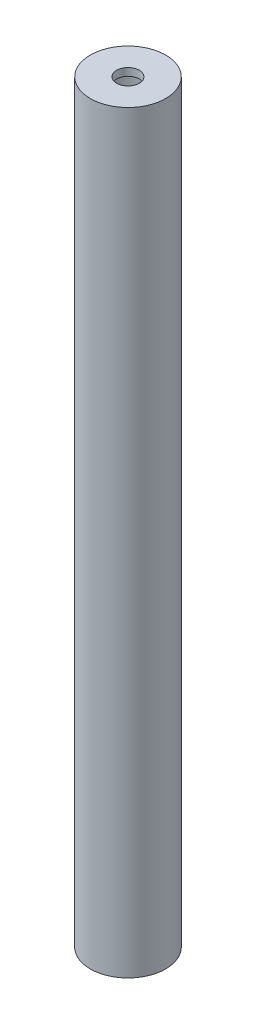
ISO-10303-21;
HEADER;
FILE_DESCRIPTION(('STEP AP214'),'2;1');
FILE_NAME('part.step','',(''),(''),'','','');
FILE_SCHEMA(('AUTOMOTIVE_DESIGN { 1 0 10303 214 1 1 1 1 }'));
ENDSEC;
DATA;
#1=APPLICATION_CONTEXT('core data for automotive mechanical design processes');
#2=APPLICATION_PROTOCOL_DEFINITION('international standard','automotive_design',2000,#1);
#3=PRODUCT_CONTEXT('',#1,'mechanical');
#4=PRODUCT('Part','Part','',(#3));
#5=PRODUCT_RELATED_PRODUCT_CATEGORY('part','',(#4));
#6=PRODUCT_DEFINITION_FORMATION('','',#4);
#7=PRODUCT_DEFINITION_CONTEXT('part definition',#1,'design');
#8=PRODUCT_DEFINITION('design','',#6,#7);
#9=PRODUCT_DEFINITION_SHAPE('','',#8);
#10=(LENGTH_UNIT() NAMED_UNIT(*) SI_UNIT(.MILLI.,.METRE.));
#11=(NAMED_UNIT(*) PLANE_ANGLE_UNIT() SI_UNIT($,.RADIAN.));
#12=(NAMED_UNIT(*) SI_UNIT($,.STERADIAN.) SOLID_ANGLE_UNIT());
#13=UNCERTAINTY_MEASURE_WITH_UNIT(LENGTH_MEASURE(1.E-05),#10,'distance_accuracy_value','');
#14=(GEOMETRIC_REPRESENTATION_CONTEXT(3) GLOBAL_UNCERTAINTY_ASSIGNED_CONTEXT((#13)) GLOBAL_UNIT_ASSIGNED_CONTEXT((#10,
#11,#12)) REPRESENTATION_CONTEXT('',''));
#15=CARTESIAN_POINT('',(0.,0.,0.));
#16=DIRECTION('',(0.,0.,1.));
#17=DIRECTION('',(1.,0.,0.));
#18=AXIS2_PLACEMENT_3D('',#15,#16,#17);
#19=CARTESIAN_POINT('',(0.,200.,0.));
#20=DIRECTION('',(0.,-1.,0.));
#21=DIRECTION('',(0.,0.,-1.));
#22=AXIS2_PLACEMENT_3D('',#19,#20,#21);
#23=CYLINDRICAL_SURFACE('',#22,8.);
#24=CARTESIAN_POINT('',(0.,198.,0.));
#25=DIRECTION('',(0.,1.,0.));
#26=DIRECTION('',(0.,0.,1.));
#27=AXIS2_PLACEMENT_3D('',#24,#25,#26);
#28=CIRCLE('',#27,8.);
#29=CARTESIAN_POINT('',(0.,198.,8.));
#30=VERTEX_POINT('',#29);
#31=EDGE_CURVE('E10',#30,#30,#28,.T.);
#32=ORIENTED_EDGE('',*,*,#31,.T.);
#33=EDGE_LOOP('',(#32));
#34=FACE_BOUND('',#33,.T.);
#35=CARTESIAN_POINT('',(0.,2.,0.));
#36=DIRECTION('',(0.,1.,0.));
#37=DIRECTION('',(0.,0.,1.));
#38=AXIS2_PLACEMENT_3D('',#35,#36,#37);
#39=CIRCLE('',#38,8.);
#40=CARTESIAN_POINT('',(0.,2.,8.));
#41=VERTEX_POINT('',#40);
#42=EDGE_CURVE('E49',#41,#41,#39,.T.);
#43=ORIENTED_EDGE('',*,*,#42,.F.);
#44=EDGE_LOOP('',(#43));
#45=FACE_BOUND('',#44,.T.);
#46=ADVANCED_FACE('F41',(#34,#45),#23,.F.);
#47=CARTESIAN_POINT('',(0.,198.,0.));
#48=DIRECTION('',(0.,1.,0.));
#49=DIRECTION('',(0.,0.,1.));
#50=AXIS2_PLACEMENT_3D('',#47,#48,#49);
#51=PLANE('',#50);
#52=CARTESIAN_POINT('',(0.,198.,0.));
#53=DIRECTION('',(0.,1.,0.));
#54=DIRECTION('',(0.,0.,1.));
#55=AXIS2_PLACEMENT_3D('',#52,#53,#54);
#56=CIRCLE('',#55,3.);
#57=CARTESIAN_POINT('',(0.,198.,3.));
#58=VERTEX_POINT('',#57);
#59=EDGE_CURVE('E59',#58,#58,#56,.T.);
#60=ORIENTED_EDGE('',*,*,#59,.T.);
#61=EDGE_LOOP('',(#60));
#62=FACE_BOUND('',#61,.T.);
#63=ORIENTED_EDGE('',*,*,#31,.F.);
#64=EDGE_LOOP('',(#63));
#65=FACE_BOUND('',#64,.T.);
#66=ADVANCED_FACE('F79',(#62,#65),#51,.F.);
#67=CARTESIAN_POINT('',(0.,2.,0.));
#68=DIRECTION('',(0.,1.,0.));
#69=DIRECTION('',(0.,0.,1.));
#70=AXIS2_PLACEMENT_3D('',#67,#68,#69);
#71=PLANE('',#70);
#72=CARTESIAN_POINT('',(0.,2.,0.));
#73=DIRECTION('',(0.,1.,0.));
#74=DIRECTION('',(0.,0.,1.));
#75=AXIS2_PLACEMENT_3D('',#72,#73,#74);
#76=CIRCLE('',#75,3.);
#77=CARTESIAN_POINT('',(0.,2.,3.));
#78=VERTEX_POINT('',#77);
#79=EDGE_CURVE('E45',#78,#78,#76,.T.);
#80=ORIENTED_EDGE('',*,*,#79,.F.);
#81=EDGE_LOOP('',(#80));
#82=FACE_BOUND('',#81,.T.);
#83=ORIENTED_EDGE('',*,*,#42,.T.);
#84=EDGE_LOOP('',(#83));
#85=FACE_BOUND('',#84,.T.);
#86=ADVANCED_FACE('F43',(#82,#85),#71,.T.);
#87=CARTESIAN_POINT('',(0.,0.,0.));
#88=DIRECTION('',(0.,1.,0.));
#89=DIRECTION('',(0.,0.,1.));
#90=AXIS2_PLACEMENT_3D('',#87,#88,#89);
#91=CYLINDRICAL_SURFACE('',#90,3.);
#92=ORIENTED_EDGE('',*,*,#79,.T.);
#93=EDGE_LOOP('',(#92));
#94=FACE_BOUND('',#93,.T.);
#95=CARTESIAN_POINT('',(0.,0.,0.));
#96=DIRECTION('',(0.,1.,0.));
#97=DIRECTION('',(0.,0.,1.));
#98=AXIS2_PLACEMENT_3D('',#95,#96,#97);
#99=CIRCLE('',#98,3.);
#100=CARTESIAN_POINT('',(0.,0.,3.));
#101=VERTEX_POINT('',#100);
#102=EDGE_CURVE('E67',#101,#101,#99,.T.);
#103=ORIENTED_EDGE('',*,*,#102,.F.);
#104=EDGE_LOOP('',(#103));
#105=FACE_BOUND('',#104,.T.);
#106=ADVANCED_FACE('F74',(#94,#105),#91,.F.);
#107=CARTESIAN_POINT('',(0.,200.,0.));
#108=DIRECTION('',(0.,1.,0.));
#109=DIRECTION('',(0.,0.,1.));
#110=AXIS2_PLACEMENT_3D('',#107,#108,#109);
#111=CIRCLE('',#110,3.);
#112=CARTESIAN_POINT('',(0.,200.,3.));
#113=VERTEX_POINT('',#112);
#114=EDGE_CURVE('E64',#113,#113,#111,.T.);
#115=ORIENTED_EDGE('',*,*,#114,.T.);
#116=EDGE_LOOP('',(#115));
#117=FACE_BOUND('',#116,.T.);
#118=ORIENTED_EDGE('',*,*,#59,.F.);
#119=EDGE_LOOP('',(#118));
#120=FACE_BOUND('',#119,.T.);
#121=ADVANCED_FACE('F93',(#117,#120),#91,.F.);
#122=CARTESIAN_POINT('',(0.,200.,0.));
#123=DIRECTION('',(0.,-1.,0.));
#124=DIRECTION('',(0.,0.,-1.));
#125=AXIS2_PLACEMENT_3D('',#122,#123,#124);
#126=CYLINDRICAL_SURFACE('',#125,10.);
#127=CARTESIAN_POINT('',(0.,200.,0.));
#128=DIRECTION('',(0.,1.,0.));
#129=DIRECTION('',(0.,0.,1.));
#130=AXIS2_PLACEMENT_3D('',#127,#128,#129);
#131=CIRCLE('',#130,10.);
#132=CARTESIAN_POINT('',(0.,200.,10.));
#133=VERTEX_POINT('',#132);
#134=EDGE_CURVE('E54',#133,#133,#131,.T.);
#135=ORIENTED_EDGE('',*,*,#134,.F.);
#136=EDGE_LOOP('',(#135));
#137=FACE_BOUND('',#136,.T.);
#138=CARTESIAN_POINT('',(0.,0.,0.));
#139=DIRECTION('',(0.,1.,0.));
#140=DIRECTION('',(0.,0.,1.));
#141=AXIS2_PLACEMENT_3D('',#138,#139,#140);
#142=CIRCLE('',#141,10.);
#143=CARTESIAN_POINT('',(0.,0.,10.));
#144=VERTEX_POINT('',#143);
#145=EDGE_CURVE('E56',#144,#144,#142,.T.);
#146=ORIENTED_EDGE('',*,*,#145,.T.);
#147=EDGE_LOOP('',(#146));
#148=FACE_BOUND('',#147,.T.);
#149=ADVANCED_FACE('F90',(#137,#148),#126,.T.);
#150=CARTESIAN_POINT('',(0.,200.,0.));
#151=DIRECTION('',(0.,1.,0.));
#152=DIRECTION('',(0.,0.,1.));
#153=AXIS2_PLACEMENT_3D('',#150,#151,#152);
#154=PLANE('',#153);
#155=ORIENTED_EDGE('',*,*,#114,.F.);
#156=EDGE_LOOP('',(#155));
#157=FACE_BOUND('',#156,.T.);
#158=ORIENTED_EDGE('',*,*,#134,.T.);
#159=EDGE_LOOP('',(#158));
#160=FACE_BOUND('',#159,.T.);
#161=ADVANCED_FACE('F92',(#157,#160),#154,.T.);
#162=CARTESIAN_POINT('',(0.,0.,0.));
#163=DIRECTION('',(0.,1.,0.));
#164=DIRECTION('',(0.,0.,1.));
#165=AXIS2_PLACEMENT_3D('',#162,#163,#164);
#166=PLANE('',#165);
#167=ORIENTED_EDGE('',*,*,#102,.T.);
#168=EDGE_LOOP('',(#167));
#169=FACE_BOUND('',#168,.T.);
#170=ORIENTED_EDGE('',*,*,#145,.F.);
#171=EDGE_LOOP('',(#170));
#172=FACE_BOUND('',#171,.T.);
#173=ADVANCED_FACE('F95',(#169,#172),#166,.F.);
#174=CLOSED_SHELL('',(#46,#66,#86,#106,#121,#149,#161,#173));
#175=MANIFOLD_SOLID_BREP('B2',#174);
#176=ADVANCED_BREP_SHAPE_REPRESENTATION('',(#18,#175),#14);
#177=SHAPE_DEFINITION_REPRESENTATION(#9,#176);
ENDSEC;
END-ISO-10303-21;
